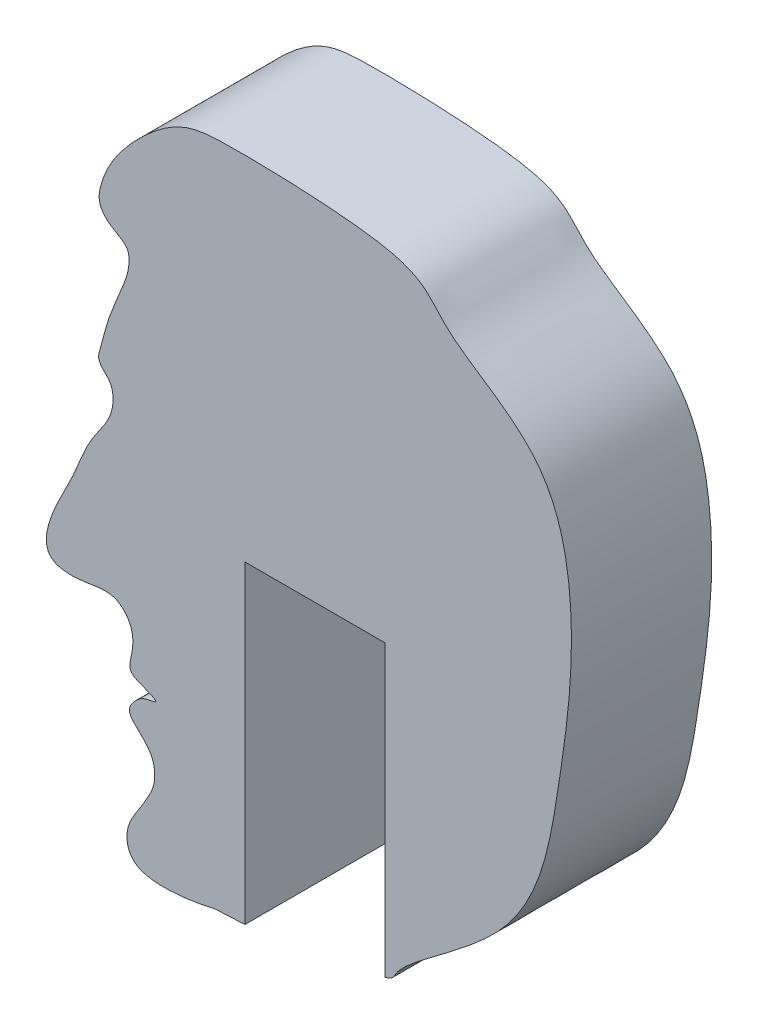
ISO-10303-21;
HEADER;
FILE_DESCRIPTION(('STEP AP214'),'2;1');
FILE_NAME('part.step','',(''),(''),'','','');
FILE_SCHEMA(('AUTOMOTIVE_DESIGN { 1 0 10303 214 1 1 1 1 }'));
ENDSEC;
DATA;
#1=APPLICATION_CONTEXT('core data for automotive mechanical design processes');
#2=APPLICATION_PROTOCOL_DEFINITION('international standard','automotive_design',2000,#1);
#3=PRODUCT_CONTEXT('',#1,'mechanical');
#4=PRODUCT('Part','Part','',(#3));
#5=PRODUCT_RELATED_PRODUCT_CATEGORY('part','',(#4));
#6=PRODUCT_DEFINITION_FORMATION('','',#4);
#7=PRODUCT_DEFINITION_CONTEXT('part definition',#1,'design');
#8=PRODUCT_DEFINITION('design','',#6,#7);
#9=PRODUCT_DEFINITION_SHAPE('','',#8);
#10=(LENGTH_UNIT() NAMED_UNIT(*) SI_UNIT(.MILLI.,.METRE.));
#11=(NAMED_UNIT(*) PLANE_ANGLE_UNIT() SI_UNIT($,.RADIAN.));
#12=(NAMED_UNIT(*) SI_UNIT($,.STERADIAN.) SOLID_ANGLE_UNIT());
#13=UNCERTAINTY_MEASURE_WITH_UNIT(LENGTH_MEASURE(1.E-05),#10,'distance_accuracy_value','');
#14=(GEOMETRIC_REPRESENTATION_CONTEXT(3) GLOBAL_UNCERTAINTY_ASSIGNED_CONTEXT((#13)) GLOBAL_UNIT_ASSIGNED_CONTEXT((#10,
#11,#12)) REPRESENTATION_CONTEXT('',''));
#15=CARTESIAN_POINT('',(0.,0.,0.));
#16=DIRECTION('',(0.,0.,1.));
#17=DIRECTION('',(1.,0.,0.));
#18=AXIS2_PLACEMENT_3D('',#15,#16,#17);
#19=CARTESIAN_POINT('',(1.8,0.,3.));
#20=DIRECTION('',(-1.,0.,0.));
#21=DIRECTION('',(0.,-1.,0.));
#22=AXIS2_PLACEMENT_3D('',#19,#20,#21);
#23=PLANE('',#22);
#24=DIRECTION('',(0.,1.,0.));
#25=VECTOR('',#24,1.);
#26=CARTESIAN_POINT('',(1.8,0.,0.));
#27=LINE('',#26,#25);
#28=CARTESIAN_POINT('',(1.8,-8.55049556904094,0.));
#29=VERTEX_POINT('',#28);
#30=CARTESIAN_POINT('',(1.8,-2.35049556904094,0.));
#31=VERTEX_POINT('',#30);
#32=EDGE_CURVE('E101',#29,#31,#27,.T.);
#33=ORIENTED_EDGE('',*,*,#32,.F.);
#34=DIRECTION('',(0.,0.,-1.));
#35=VECTOR('',#34,1.);
#36=CARTESIAN_POINT('',(1.8,-8.55049556904094,3.));
#37=LINE('',#36,#35);
#38=CARTESIAN_POINT('',(1.8,-8.55049556904094,3.));
#39=VERTEX_POINT('',#38);
#40=EDGE_CURVE('E11',#39,#29,#37,.T.);
#41=ORIENTED_EDGE('',*,*,#40,.F.);
#42=DIRECTION('',(0.,1.,0.));
#43=VECTOR('',#42,1.);
#44=CARTESIAN_POINT('',(1.8,0.,3.));
#45=LINE('',#44,#43);
#46=CARTESIAN_POINT('',(1.8,-2.35049556904094,3.));
#47=VERTEX_POINT('',#46);
#48=EDGE_CURVE('E83',#39,#47,#45,.T.);
#49=ORIENTED_EDGE('',*,*,#48,.T.);
#50=DIRECTION('',(0.,0.,-1.));
#51=VECTOR('',#50,1.);
#52=CARTESIAN_POINT('',(1.8,-2.35049556904094,3.));
#53=LINE('',#52,#51);
#54=EDGE_CURVE('E51',#47,#31,#53,.T.);
#55=ORIENTED_EDGE('',*,*,#54,.T.);
#56=EDGE_LOOP('',(#33,#41,#49,#55));
#57=FACE_BOUND('',#56,.T.);
#58=ADVANCED_FACE('F35',(#57),#23,.T.);
#59=CARTESIAN_POINT('',(1.8,-8.55049556904094,3.));
#60=CARTESIAN_POINT('',(1.98338335354472,-8.49447880331943,3.));
#61=CARTESIAN_POINT('',(2.0563733773062,-8.07922942587934,3.));
#62=CARTESIAN_POINT('',(4.96407571318589,-6.44449877239547,3.));
#63=CARTESIAN_POINT('',(5.5374477219977,-3.10131831236894,3.));
#64=CARTESIAN_POINT('',(5.98568420633833,0.111969223633251,3.));
#65=CARTESIAN_POINT('',(5.29741751423549,2.83211460621264,3.));
#66=CARTESIAN_POINT('',(2.71316128193223,4.2056614834707,3.));
#67=CARTESIAN_POINT('',(2.79009430687501,5.07372550510104,3.));
#68=CARTESIAN_POINT('',(-1.22841194422824,5.22367235218222,3.));
#69=CARTESIAN_POINT('',(-2.59244339447434,5.14245641313913,3.));
#70=CARTESIAN_POINT('',(-3.62104941407903,4.28710017584848,3.));
#71=CARTESIAN_POINT('',(-4.21760701415671,3.4628263465662,3.));
#72=CARTESIAN_POINT('',(-4.35564291018577,2.74858330113314,3.));
#73=CARTESIAN_POINT('',(-4.09087434585584,2.40052984126324,3.));
#74=CARTESIAN_POINT('',(-3.71019171273516,2.28897410218257,3.));
#75=CARTESIAN_POINT('',(-3.65239350322813,1.84212235648949,3.));
#76=CARTESIAN_POINT('',(-3.86353131730481,1.32005412236333,3.));
#77=CARTESIAN_POINT('',(-4.14918212712933,0.667065868515918,3.));
#78=CARTESIAN_POINT('',(-4.25721513575194,0.162123331215003,3.));
#79=CARTESIAN_POINT('',(-4.346512774575,-0.121912565943362,3.));
#80=CARTESIAN_POINT('',(-4.26210408222448,-0.304075751322085,3.));
#81=CARTESIAN_POINT('',(-4.07659509693767,-0.424060165158793,3.));
#82=CARTESIAN_POINT('',(-3.99692069059607,-0.734301627694705,3.));
#83=CARTESIAN_POINT('',(-4.07463602485311,-1.19315371206362,3.));
#84=CARTESIAN_POINT('',(-4.56720502848893,-1.74922371081515,3.));
#85=CARTESIAN_POINT('',(-4.82284796819717,-2.53595528743337,3.));
#86=CARTESIAN_POINT('',(-5.24767860916015,-3.28561319258462,3.));
#87=CARTESIAN_POINT('',(-5.68958886263796,-4.4095787734609,3.));
#88=CARTESIAN_POINT('',(-4.64309611630773,-4.49556335499498,3.));
#89=CARTESIAN_POINT('',(-4.05270346394928,-4.27772127266185,3.));
#90=CARTESIAN_POINT('',(-3.60318786344314,-4.71261350130042,3.));
#91=CARTESIAN_POINT('',(-3.56553396121132,-5.12997668665869,3.));
#92=CARTESIAN_POINT('',(-3.73206705033682,-5.64926012270845,3.));
#93=CARTESIAN_POINT('',(-3.38714304061516,-5.72985838026725,3.));
#94=CARTESIAN_POINT('',(-3.00318182906723,-5.90965899416458,3.));
#95=CARTESIAN_POINT('',(-3.37731033222743,-5.93909610281839,3.));
#96=CARTESIAN_POINT('',(-3.53373847669815,-6.07641357496284,3.));
#97=CARTESIAN_POINT('',(-3.76168257714449,-6.35703474423527,3.));
#98=CARTESIAN_POINT('',(-3.42068909994113,-6.65844129616985,3.));
#99=CARTESIAN_POINT('',(-3.13400227535613,-6.96057509124612,3.));
#100=CARTESIAN_POINT('',(-3.10469428030821,-7.42764938184345,3.));
#101=CARTESIAN_POINT('',(-3.28183995747688,-7.76662759025826,3.));
#102=CARTESIAN_POINT('',(-3.49018016650037,-8.11470281608938,3.));
#103=CARTESIAN_POINT('',(-3.78274936576904,-8.52236987015006,3.));
#104=CARTESIAN_POINT('',(-3.65692353151574,-9.46124972061329,3.));
#105=CARTESIAN_POINT('',(-2.06450528332021,-9.15911649686615,3.));
#106=CARTESIAN_POINT('',(-1.8148072214283,-9.08909306964434,3.));
#107=CARTESIAN_POINT('',(-1.29042841256869,-9.07874474366509,3.));
#108=CARTESIAN_POINT('',(-1.2,-9.07086462355473,3.));
#109=B_SPLINE_CURVE_WITH_KNOTS('',3,(#59,#60,#61,#62,#63,#64,#65,#66,#67,#68,#69,#70,#71,#72,
#73,#74,#75,#76,#77,#78,#79,#80,#81,#82,#83,#84,#85,#86,#87,#88,#89,#90,#91,#92,#93,#94,#95,#96,
#97,#98,#99,#100,#101,#102,#103,#104,#105,#106,#107,#108),.UNSPECIFIED.,.F.,.F.,(4,1,1,1,1,1,1,
1,1,1,1,1,1,1,1,1,1,1,1,1,1,1,1,1,1,1,1,1,1,1,1,1,1,1,1,1,1,1,1,1,1,1,1,1,1,1,1,4),
(0.0357213793476706,0.0481112802206396,0.11621842361159,0.196215850474163,0.287146162102035,
0.339827994471135,0.385710092522578,0.445307385065615,0.496569769768969,0.517293509626799,
0.547662027168807,0.578023306355916,0.585346504170681,0.593439586983624,0.605041399599162,
0.607152614295083,0.622515629698208,0.64130457495729,0.654770405996345,0.657233564455898,
0.660589327432177,0.66714963564536,0.671240491172361,0.681073378141683,0.696862323590988,
0.71966254114734,0.733854217630304,0.759566929445118,0.772793822634793,0.791587870502146,
0.797896073419171,0.811273687854484,0.818616701422012,0.828455888725392,0.832672087545646,
0.83770481733886,0.843454137613516,0.849075736040522,0.857765981537382,0.867553457241099,
0.877942683965357,0.88582310137448,0.892850099408238,0.905030759261407,0.918978952097173,
0.943844644742531,0.947370898732409,0.954241491995956),.UNSPECIFIED.);
#110=DIRECTION('',(0.,0.,-1.));
#111=VECTOR('',#110,1.);
#112=SURFACE_OF_LINEAR_EXTRUSION('',#109,#111);
#113=CARTESIAN_POINT('',(1.8,-8.55049556904094,0.));
#114=CARTESIAN_POINT('',(1.98338335354472,-8.49447880331943,0.));
#115=CARTESIAN_POINT('',(2.0563733773062,-8.07922942587934,0.));
#116=CARTESIAN_POINT('',(4.96407571318589,-6.44449877239547,0.));
#117=CARTESIAN_POINT('',(5.5374477219977,-3.10131831236894,0.));
#118=CARTESIAN_POINT('',(5.98568420633833,0.111969223633251,0.));
#119=CARTESIAN_POINT('',(5.29741751423549,2.83211460621264,0.));
#120=CARTESIAN_POINT('',(2.71316128193223,4.2056614834707,0.));
#121=CARTESIAN_POINT('',(2.79009430687501,5.07372550510104,0.));
#122=CARTESIAN_POINT('',(-1.22841194422824,5.22367235218222,0.));
#123=CARTESIAN_POINT('',(-2.59244339447434,5.14245641313913,0.));
#124=CARTESIAN_POINT('',(-3.62104941407903,4.28710017584848,0.));
#125=CARTESIAN_POINT('',(-4.21760701415671,3.4628263465662,0.));
#126=CARTESIAN_POINT('',(-4.35564291018577,2.74858330113314,0.));
#127=CARTESIAN_POINT('',(-4.09087434585584,2.40052984126324,0.));
#128=CARTESIAN_POINT('',(-3.71019171273516,2.28897410218257,0.));
#129=CARTESIAN_POINT('',(-3.65239350322813,1.84212235648949,0.));
#130=CARTESIAN_POINT('',(-3.86353131730481,1.32005412236333,0.));
#131=CARTESIAN_POINT('',(-4.14918212712933,0.667065868515918,0.));
#132=CARTESIAN_POINT('',(-4.25721513575194,0.162123331215003,0.));
#133=CARTESIAN_POINT('',(-4.346512774575,-0.121912565943362,0.));
#134=CARTESIAN_POINT('',(-4.26210408222448,-0.304075751322085,0.));
#135=CARTESIAN_POINT('',(-4.07659509693767,-0.424060165158793,0.));
#136=CARTESIAN_POINT('',(-3.99692069059607,-0.734301627694705,0.));
#137=CARTESIAN_POINT('',(-4.07463602485311,-1.19315371206362,0.));
#138=CARTESIAN_POINT('',(-4.56720502848893,-1.74922371081515,0.));
#139=CARTESIAN_POINT('',(-4.82284796819717,-2.53595528743337,0.));
#140=CARTESIAN_POINT('',(-5.24767860916015,-3.28561319258462,0.));
#141=CARTESIAN_POINT('',(-5.68958886263796,-4.4095787734609,0.));
#142=CARTESIAN_POINT('',(-4.64309611630773,-4.49556335499498,0.));
#143=CARTESIAN_POINT('',(-4.05270346394928,-4.27772127266185,0.));
#144=CARTESIAN_POINT('',(-3.60318786344314,-4.71261350130042,0.));
#145=CARTESIAN_POINT('',(-3.56553396121132,-5.12997668665869,0.));
#146=CARTESIAN_POINT('',(-3.73206705033682,-5.64926012270845,0.));
#147=CARTESIAN_POINT('',(-3.38714304061516,-5.72985838026725,0.));
#148=CARTESIAN_POINT('',(-3.00318182906723,-5.90965899416458,0.));
#149=CARTESIAN_POINT('',(-3.37731033222743,-5.93909610281839,0.));
#150=CARTESIAN_POINT('',(-3.53373847669815,-6.07641357496284,0.));
#151=CARTESIAN_POINT('',(-3.76168257714449,-6.35703474423527,0.));
#152=CARTESIAN_POINT('',(-3.42068909994113,-6.65844129616985,0.));
#153=CARTESIAN_POINT('',(-3.13400227535613,-6.96057509124612,0.));
#154=CARTESIAN_POINT('',(-3.10469428030821,-7.42764938184345,0.));
#155=CARTESIAN_POINT('',(-3.28183995747688,-7.76662759025826,0.));
#156=CARTESIAN_POINT('',(-3.49018016650037,-8.11470281608938,0.));
#157=CARTESIAN_POINT('',(-3.78274936576904,-8.52236987015006,0.));
#158=CARTESIAN_POINT('',(-3.65692353151574,-9.46124972061329,0.));
#159=CARTESIAN_POINT('',(-2.06450528332021,-9.15911649686615,0.));
#160=CARTESIAN_POINT('',(-1.8148072214283,-9.08909306964434,0.));
#161=CARTESIAN_POINT('',(-1.29042841256869,-9.07874474366509,0.));
#162=CARTESIAN_POINT('',(-1.2,-9.07086462355473,0.));
#163=B_SPLINE_CURVE_WITH_KNOTS('',3,(#113,#114,#115,#116,#117,#118,#119,#120,#121,#122,#123,
#124,#125,#126,#127,#128,#129,#130,#131,#132,#133,#134,#135,#136,#137,#138,#139,#140,#141,#142,
#143,#144,#145,#146,#147,#148,#149,#150,#151,#152,#153,#154,#155,#156,#157,#158,#159,#160,#161,
#162),.UNSPECIFIED.,.F.,.F.,(4,1,1,1,1,1,1,1,1,1,1,1,1,1,1,1,1,1,1,1,1,1,1,1,1,1,1,1,1,1,1,1,1,
1,1,1,1,1,1,1,1,1,1,1,1,1,1,4),(0.0357213793476706,0.0481112802206396,0.11621842361159,
0.196215850474163,0.287146162102035,0.339827994471135,0.385710092522578,0.445307385065615,
0.496569769768969,0.517293509626799,0.547662027168807,0.578023306355916,0.585346504170681,
0.593439586983624,0.605041399599162,0.607152614295083,0.622515629698208,0.64130457495729,
0.654770405996345,0.657233564455898,0.660589327432177,0.66714963564536,0.671240491172361,
0.681073378141683,0.696862323590988,0.71966254114734,0.733854217630304,0.759566929445118,
0.772793822634793,0.791587870502146,0.797896073419171,0.811273687854484,0.818616701422012,
0.828455888725392,0.832672087545646,0.83770481733886,0.843454137613516,0.849075736040522,
0.857765981537382,0.867553457241099,0.877942683965357,0.88582310137448,0.892850099408238,
0.905030759261407,0.918978952097173,0.943844644742531,0.947370898732409,0.954241491995956),.UNSPECIFIED.);
#164=CARTESIAN_POINT('',(-1.2,-9.07086462355473,0.));
#165=VERTEX_POINT('',#164);
#166=EDGE_CURVE('E89',#29,#165,#163,.T.);
#167=ORIENTED_EDGE('',*,*,#166,.T.);
#168=DIRECTION('',(0.,0.,-1.));
#169=VECTOR('',#168,1.);
#170=CARTESIAN_POINT('',(-1.2,-9.07086462355473,3.));
#171=LINE('',#170,#169);
#172=CARTESIAN_POINT('',(-1.2,-9.07086462355473,3.));
#173=VERTEX_POINT('',#172);
#174=EDGE_CURVE('E43',#173,#165,#171,.T.);
#175=ORIENTED_EDGE('',*,*,#174,.F.);
#176=EDGE_CURVE('E77',#39,#173,#109,.T.);
#177=ORIENTED_EDGE('',*,*,#176,.F.);
#178=ORIENTED_EDGE('',*,*,#40,.T.);
#179=EDGE_LOOP('',(#167,#175,#177,#178));
#180=FACE_BOUND('',#179,.T.);
#181=ADVANCED_FACE('F87',(#180),#112,.F.);
#182=CARTESIAN_POINT('',(-1.2,0.,3.));
#183=DIRECTION('',(1.,0.,0.));
#184=DIRECTION('',(0.,1.,0.));
#185=AXIS2_PLACEMENT_3D('',#182,#183,#184);
#186=PLANE('',#185);
#187=DIRECTION('',(0.,-1.,0.));
#188=VECTOR('',#187,1.);
#189=CARTESIAN_POINT('',(-1.2,0.,0.));
#190=LINE('',#189,#188);
#191=CARTESIAN_POINT('',(-1.2,-2.35049556904094,0.));
#192=VERTEX_POINT('',#191);
#193=EDGE_CURVE('E106',#192,#165,#190,.T.);
#194=ORIENTED_EDGE('',*,*,#193,.F.);
#195=DIRECTION('',(0.,0.,-1.));
#196=VECTOR('',#195,1.);
#197=CARTESIAN_POINT('',(-1.2,-2.35049556904094,3.));
#198=LINE('',#197,#196);
#199=CARTESIAN_POINT('',(-1.2,-2.35049556904094,3.));
#200=VERTEX_POINT('',#199);
#201=EDGE_CURVE('E64',#200,#192,#198,.T.);
#202=ORIENTED_EDGE('',*,*,#201,.F.);
#203=DIRECTION('',(0.,-1.,0.));
#204=VECTOR('',#203,1.);
#205=CARTESIAN_POINT('',(-1.2,0.,3.));
#206=LINE('',#205,#204);
#207=EDGE_CURVE('E82',#200,#173,#206,.T.);
#208=ORIENTED_EDGE('',*,*,#207,.T.);
#209=ORIENTED_EDGE('',*,*,#174,.T.);
#210=EDGE_LOOP('',(#194,#202,#208,#209));
#211=FACE_BOUND('',#210,.T.);
#212=ADVANCED_FACE('F92',(#211),#186,.T.);
#213=CARTESIAN_POINT('',(0.,-2.35049556904094,3.));
#214=DIRECTION('',(0.,-1.,0.));
#215=DIRECTION('',(0.,0.,-1.));
#216=AXIS2_PLACEMENT_3D('',#213,#214,#215);
#217=PLANE('',#216);
#218=DIRECTION('',(-1.,0.,0.));
#219=VECTOR('',#218,1.);
#220=CARTESIAN_POINT('',(0.,-2.35049556904094,0.));
#221=LINE('',#220,#219);
#222=EDGE_CURVE('E111',#31,#192,#221,.T.);
#223=ORIENTED_EDGE('',*,*,#222,.F.);
#224=ORIENTED_EDGE('',*,*,#54,.F.);
#225=DIRECTION('',(-1.,0.,0.));
#226=VECTOR('',#225,1.);
#227=CARTESIAN_POINT('',(0.,-2.35049556904094,3.));
#228=LINE('',#227,#226);
#229=EDGE_CURVE('E93',#47,#200,#228,.T.);
#230=ORIENTED_EDGE('',*,*,#229,.T.);
#231=ORIENTED_EDGE('',*,*,#201,.T.);
#232=EDGE_LOOP('',(#223,#224,#230,#231));
#233=FACE_BOUND('',#232,.T.);
#234=ADVANCED_FACE('F116',(#233),#217,.T.);
#235=CARTESIAN_POINT('',(0.,0.,3.));
#236=DIRECTION('',(0.,0.,1.));
#237=DIRECTION('',(1.,0.,0.));
#238=AXIS2_PLACEMENT_3D('',#235,#236,#237);
#239=PLANE('',#238);
#240=ORIENTED_EDGE('',*,*,#48,.F.);
#241=ORIENTED_EDGE('',*,*,#176,.T.);
#242=ORIENTED_EDGE('',*,*,#207,.F.);
#243=ORIENTED_EDGE('',*,*,#229,.F.);
#244=EDGE_LOOP('',(#240,#241,#242,#243));
#245=FACE_BOUND('',#244,.T.);
#246=ADVANCED_FACE('F79',(#245),#239,.T.);
#247=CARTESIAN_POINT('',(0.,0.,0.));
#248=DIRECTION('',(0.,0.,1.));
#249=DIRECTION('',(1.,0.,0.));
#250=AXIS2_PLACEMENT_3D('',#247,#248,#249);
#251=PLANE('',#250);
#252=ORIENTED_EDGE('',*,*,#32,.T.);
#253=ORIENTED_EDGE('',*,*,#222,.T.);
#254=ORIENTED_EDGE('',*,*,#193,.T.);
#255=ORIENTED_EDGE('',*,*,#166,.F.);
#256=EDGE_LOOP('',(#252,#253,#254,#255));
#257=FACE_BOUND('',#256,.T.);
#258=ADVANCED_FACE('F123',(#257),#251,.F.);
#259=CLOSED_SHELL('',(#58,#181,#212,#234,#246,#258));
#260=MANIFOLD_SOLID_BREP('B2',#259);
#261=ADVANCED_BREP_SHAPE_REPRESENTATION('',(#18,#260),#14);
#262=SHAPE_DEFINITION_REPRESENTATION(#9,#261);
ENDSEC;
END-ISO-10303-21;
